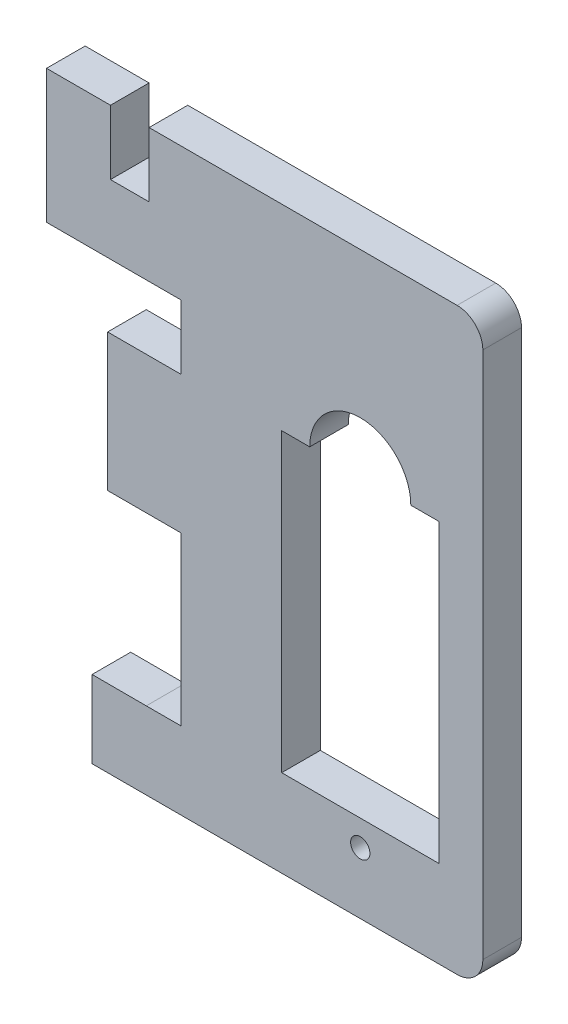
ISO-10303-21;
HEADER;
FILE_DESCRIPTION(('STEP AP214'),'2;1');
FILE_NAME('part.step','',(''),(''),'','','');
FILE_SCHEMA(('AUTOMOTIVE_DESIGN { 1 0 10303 214 1 1 1 1 }'));
ENDSEC;
DATA;
#1=APPLICATION_CONTEXT('core data for automotive mechanical design processes');
#2=APPLICATION_PROTOCOL_DEFINITION('international standard','automotive_design',2000,#1);
#3=PRODUCT_CONTEXT('',#1,'mechanical');
#4=PRODUCT('Part','Part','',(#3));
#5=PRODUCT_RELATED_PRODUCT_CATEGORY('part','',(#4));
#6=PRODUCT_DEFINITION_FORMATION('','',#4);
#7=PRODUCT_DEFINITION_CONTEXT('part definition',#1,'design');
#8=PRODUCT_DEFINITION('design','',#6,#7);
#9=PRODUCT_DEFINITION_SHAPE('','',#8);
#10=(LENGTH_UNIT() NAMED_UNIT(*) SI_UNIT(.MILLI.,.METRE.));
#11=(NAMED_UNIT(*) PLANE_ANGLE_UNIT() SI_UNIT($,.RADIAN.));
#12=(NAMED_UNIT(*) SI_UNIT($,.STERADIAN.) SOLID_ANGLE_UNIT());
#13=UNCERTAINTY_MEASURE_WITH_UNIT(LENGTH_MEASURE(1.E-05),#10,'distance_accuracy_value','');
#14=(GEOMETRIC_REPRESENTATION_CONTEXT(3) GLOBAL_UNCERTAINTY_ASSIGNED_CONTEXT((#13)) GLOBAL_UNIT_ASSIGNED_CONTEXT((#10,
#11,#12)) REPRESENTATION_CONTEXT('',''));
#15=CARTESIAN_POINT('',(0.,0.,0.));
#16=DIRECTION('',(0.,0.,1.));
#17=DIRECTION('',(1.,0.,0.));
#18=AXIS2_PLACEMENT_3D('',#15,#16,#17);
#19=CARTESIAN_POINT('',(-16.2431205040282,-16.6158037405696,0.));
#20=DIRECTION('',(0.,1.,0.));
#21=DIRECTION('',(-1.,0.,0.));
#22=AXIS2_PLACEMENT_3D('',#19,#20,#21);
#23=PLANE('',#22);
#24=DIRECTION('',(-1.,0.,0.));
#25=VECTOR('',#24,1.);
#26=CARTESIAN_POINT('',(-16.2431205040282,-16.6158037405696,0.));
#27=LINE('',#26,#25);
#28=CARTESIAN_POINT('',(-14.0681205040282,-16.6158037405696,0.));
#29=VERTEX_POINT('',#28);
#30=CARTESIAN_POINT('',(-16.2431205040282,-16.6158037405696,0.));
#31=VERTEX_POINT('',#30);
#32=EDGE_CURVE('E631',#29,#31,#27,.T.);
#33=ORIENTED_EDGE('',*,*,#32,.F.);
#34=DIRECTION('',(0.,0.,1.));
#35=VECTOR('',#34,1.);
#36=CARTESIAN_POINT('',(-14.0681205040282,-16.6158037405696,0.));
#37=LINE('',#36,#35);
#38=CARTESIAN_POINT('',(-14.0681205040282,-16.6158037405696,3.));
#39=VERTEX_POINT('',#38);
#40=EDGE_CURVE('E11',#29,#39,#37,.T.);
#41=ORIENTED_EDGE('',*,*,#40,.T.);
#42=DIRECTION('',(-1.,0.,0.));
#43=VECTOR('',#42,1.);
#44=CARTESIAN_POINT('',(-16.2431205040282,-16.6158037405696,3.));
#45=LINE('',#44,#43);
#46=CARTESIAN_POINT('',(-16.2431205040282,-16.6158037405696,3.));
#47=VERTEX_POINT('',#46);
#48=EDGE_CURVE('E216',#39,#47,#45,.T.);
#49=ORIENTED_EDGE('',*,*,#48,.T.);
#50=DIRECTION('',(0.,0.,1.));
#51=VECTOR('',#50,1.);
#52=CARTESIAN_POINT('',(-16.2431205040282,-16.6158037405696,0.));
#53=LINE('',#52,#51);
#54=EDGE_CURVE('E231',#31,#47,#53,.T.);
#55=ORIENTED_EDGE('',*,*,#54,.F.);
#56=EDGE_LOOP('',(#33,#41,#49,#55));
#57=FACE_BOUND('',#56,.T.);
#58=ADVANCED_FACE('F36',(#57),#23,.F.);
#59=CARTESIAN_POINT('',(-29.7617959455415,-11.7350085178876,3.));
#60=DIRECTION('',(0.,1.,0.));
#61=DIRECTION('',(0.,0.,1.));
#62=AXIS2_PLACEMENT_3D('',#59,#60,#61);
#63=PLANE('',#62);
#64=DIRECTION('',(1.,0.,0.));
#65=VECTOR('',#64,1.);
#66=CARTESIAN_POINT('',(-29.7617959455415,-11.7350085178876,0.));
#67=LINE('',#66,#65);
#68=CARTESIAN_POINT('',(-34.5063516050756,-11.7350085178875,0.));
#69=VERTEX_POINT('',#68);
#70=CARTESIAN_POINT('',(-24.0650463455694,-11.7350085178876,0.));
#71=VERTEX_POINT('',#70);
#72=EDGE_CURVE('E233',#69,#71,#67,.T.);
#73=ORIENTED_EDGE('',*,*,#72,.T.);
#74=DIRECTION('',(0.,0.,-1.));
#75=VECTOR('',#74,1.);
#76=CARTESIAN_POINT('',(-24.0650463455694,-11.7350085178876,3.));
#77=LINE('',#76,#75);
#78=CARTESIAN_POINT('',(-24.0650463455694,-11.7350085178876,3.));
#79=VERTEX_POINT('',#78);
#80=EDGE_CURVE('E208',#79,#71,#77,.T.);
#81=ORIENTED_EDGE('',*,*,#80,.F.);
#82=DIRECTION('',(1.,0.,0.));
#83=VECTOR('',#82,1.);
#84=CARTESIAN_POINT('',(-34.5063516050756,-11.7350085178875,3.));
#85=LINE('',#84,#83);
#86=CARTESIAN_POINT('',(-34.5063516050756,-11.7350085178875,3.));
#87=VERTEX_POINT('',#86);
#88=EDGE_CURVE('E240',#87,#79,#85,.T.);
#89=ORIENTED_EDGE('',*,*,#88,.F.);
#90=DIRECTION('',(0.,0.,-1.));
#91=VECTOR('',#90,1.);
#92=CARTESIAN_POINT('',(-34.5063516050756,-11.7350085178875,3.));
#93=LINE('',#92,#91);
#94=EDGE_CURVE('E279',#87,#69,#93,.T.);
#95=ORIENTED_EDGE('',*,*,#94,.T.);
#96=EDGE_LOOP('',(#73,#81,#89,#95));
#97=FACE_BOUND('',#96,.T.);
#98=ADVANCED_FACE('F38',(#97),#63,.F.);
#99=CARTESIAN_POINT('',(-24.0650463455694,-11.7350085178876,3.));
#100=DIRECTION('',(1.,0.,0.));
#101=DIRECTION('',(0.,0.,-1.));
#102=AXIS2_PLACEMENT_3D('',#99,#100,#101);
#103=PLANE('',#102);
#104=DIRECTION('',(0.,-1.,0.));
#105=VECTOR('',#104,1.);
#106=CARTESIAN_POINT('',(-24.0650463455694,-11.7350085178876,0.));
#107=LINE('',#106,#105);
#108=CARTESIAN_POINT('',(-24.0650463455694,-16.7350085178876,0.));
#109=VERTEX_POINT('',#108);
#110=EDGE_CURVE('E281',#71,#109,#107,.T.);
#111=ORIENTED_EDGE('',*,*,#110,.T.);
#112=DIRECTION('',(0.,0.,-1.));
#113=VECTOR('',#112,1.);
#114=CARTESIAN_POINT('',(-24.0650463455694,-16.7350085178876,3.));
#115=LINE('',#114,#113);
#116=CARTESIAN_POINT('',(-24.0650463455694,-16.7350085178876,3.));
#117=VERTEX_POINT('',#116);
#118=EDGE_CURVE('E368',#117,#109,#115,.T.);
#119=ORIENTED_EDGE('',*,*,#118,.F.);
#120=DIRECTION('',(0.,-1.,0.));
#121=VECTOR('',#120,1.);
#122=CARTESIAN_POINT('',(-24.0650463455694,-11.7350085178876,3.));
#123=LINE('',#122,#121);
#124=EDGE_CURVE('E242',#79,#117,#123,.T.);
#125=ORIENTED_EDGE('',*,*,#124,.F.);
#126=ORIENTED_EDGE('',*,*,#80,.T.);
#127=EDGE_LOOP('',(#111,#119,#125,#126));
#128=FACE_BOUND('',#127,.T.);
#129=ADVANCED_FACE('F376',(#128),#103,.F.);
#130=CARTESIAN_POINT('',(-24.0650463455694,-16.7350085178876,3.));
#131=DIRECTION('',(0.,-1.,0.));
#132=DIRECTION('',(0.,0.,-1.));
#133=AXIS2_PLACEMENT_3D('',#130,#131,#132);
#134=PLANE('',#133);
#135=DIRECTION('',(-1.,0.,0.));
#136=VECTOR('',#135,1.);
#137=CARTESIAN_POINT('',(-24.0650463455694,-16.7350085178876,0.));
#138=LINE('',#137,#136);
#139=CARTESIAN_POINT('',(-29.7617959455415,-16.7350085178876,0.));
#140=VERTEX_POINT('',#139);
#141=EDGE_CURVE('E283',#109,#140,#138,.T.);
#142=ORIENTED_EDGE('',*,*,#141,.T.);
#143=DIRECTION('',(0.,0.,-1.));
#144=VECTOR('',#143,1.);
#145=CARTESIAN_POINT('',(-29.7617959455415,-16.7350085178876,3.));
#146=LINE('',#145,#144);
#147=CARTESIAN_POINT('',(-29.7617959455415,-16.7350085178876,3.));
#148=VERTEX_POINT('',#147);
#149=EDGE_CURVE('E365',#148,#140,#146,.T.);
#150=ORIENTED_EDGE('',*,*,#149,.F.);
#151=DIRECTION('',(-1.,0.,0.));
#152=VECTOR('',#151,1.);
#153=CARTESIAN_POINT('',(-24.0650463455694,-16.7350085178876,3.));
#154=LINE('',#153,#152);
#155=EDGE_CURVE('E245',#117,#148,#154,.T.);
#156=ORIENTED_EDGE('',*,*,#155,.F.);
#157=ORIENTED_EDGE('',*,*,#118,.T.);
#158=EDGE_LOOP('',(#142,#150,#156,#157));
#159=FACE_BOUND('',#158,.T.);
#160=ADVANCED_FACE('F388',(#159),#134,.F.);
#161=CARTESIAN_POINT('',(-29.7617959455415,-16.7350085178876,3.));
#162=DIRECTION('',(1.,0.,0.));
#163=DIRECTION('',(0.,0.,-1.));
#164=AXIS2_PLACEMENT_3D('',#161,#162,#163);
#165=PLANE('',#164);
#166=DIRECTION('',(0.,-1.,0.));
#167=VECTOR('',#166,1.);
#168=CARTESIAN_POINT('',(-29.7617959455415,-16.7350085178876,0.));
#169=LINE('',#168,#167);
#170=CARTESIAN_POINT('',(-29.7617959455415,-27.4012776831346,0.));
#171=VERTEX_POINT('',#170);
#172=EDGE_CURVE('E285',#140,#171,#169,.T.);
#173=ORIENTED_EDGE('',*,*,#172,.T.);
#174=DIRECTION('',(0.,0.,-1.));
#175=VECTOR('',#174,1.);
#176=CARTESIAN_POINT('',(-29.7617959455415,-27.4012776831346,3.));
#177=LINE('',#176,#175);
#178=CARTESIAN_POINT('',(-29.7617959455415,-27.4012776831346,3.));
#179=VERTEX_POINT('',#178);
#180=EDGE_CURVE('E362',#179,#171,#177,.T.);
#181=ORIENTED_EDGE('',*,*,#180,.F.);
#182=DIRECTION('',(0.,-1.,0.));
#183=VECTOR('',#182,1.);
#184=CARTESIAN_POINT('',(-29.7617959455415,-16.7350085178876,3.));
#185=LINE('',#184,#183);
#186=EDGE_CURVE('E247',#148,#179,#185,.T.);
#187=ORIENTED_EDGE('',*,*,#186,.F.);
#188=ORIENTED_EDGE('',*,*,#149,.T.);
#189=EDGE_LOOP('',(#173,#181,#187,#188));
#190=FACE_BOUND('',#189,.T.);
#191=ADVANCED_FACE('F392',(#190),#165,.F.);
#192=CARTESIAN_POINT('',(-29.7617959455415,-27.4012776831346,3.));
#193=DIRECTION('',(0.,1.,0.));
#194=DIRECTION('',(0.,0.,1.));
#195=AXIS2_PLACEMENT_3D('',#192,#193,#194);
#196=PLANE('',#195);
#197=DIRECTION('',(1.,0.,0.));
#198=VECTOR('',#197,1.);
#199=CARTESIAN_POINT('',(-29.7617959455415,-27.4012776831346,0.));
#200=LINE('',#199,#198);
#201=CARTESIAN_POINT('',(-24.0650463455694,-27.4012776831346,0.));
#202=VERTEX_POINT('',#201);
#203=EDGE_CURVE('E287',#171,#202,#200,.T.);
#204=ORIENTED_EDGE('',*,*,#203,.T.);
#205=DIRECTION('',(0.,0.,-1.));
#206=VECTOR('',#205,1.);
#207=CARTESIAN_POINT('',(-24.0650463455694,-27.4012776831346,3.));
#208=LINE('',#207,#206);
#209=CARTESIAN_POINT('',(-24.0650463455694,-27.4012776831346,3.));
#210=VERTEX_POINT('',#209);
#211=EDGE_CURVE('E359',#210,#202,#208,.T.);
#212=ORIENTED_EDGE('',*,*,#211,.F.);
#213=DIRECTION('',(1.,0.,0.));
#214=VECTOR('',#213,1.);
#215=CARTESIAN_POINT('',(-29.7617959455415,-27.4012776831346,3.));
#216=LINE('',#215,#214);
#217=EDGE_CURVE('E249',#179,#210,#216,.T.);
#218=ORIENTED_EDGE('',*,*,#217,.F.);
#219=ORIENTED_EDGE('',*,*,#180,.T.);
#220=EDGE_LOOP('',(#204,#212,#218,#219));
#221=FACE_BOUND('',#220,.T.);
#222=ADVANCED_FACE('F466',(#221),#196,.F.);
#223=CARTESIAN_POINT('',(-24.0650463455694,-27.4012776831346,3.));
#224=DIRECTION('',(1.,0.,0.));
#225=DIRECTION('',(0.,0.,-1.));
#226=AXIS2_PLACEMENT_3D('',#223,#224,#225);
#227=PLANE('',#226);
#228=DIRECTION('',(0.,-1.,0.));
#229=VECTOR('',#228,1.);
#230=CARTESIAN_POINT('',(-24.0650463455694,-27.4012776831346,0.));
#231=LINE('',#230,#229);
#232=CARTESIAN_POINT('',(-24.0650463455694,-40.3800883305045,0.));
#233=VERTEX_POINT('',#232);
#234=EDGE_CURVE('E289',#202,#233,#231,.T.);
#235=ORIENTED_EDGE('',*,*,#234,.T.);
#236=DIRECTION('',(0.,0.,-1.));
#237=VECTOR('',#236,1.);
#238=CARTESIAN_POINT('',(-24.0650463455694,-40.3800883305045,3.));
#239=LINE('',#238,#237);
#240=CARTESIAN_POINT('',(-24.0650463455694,-40.3800883305045,3.));
#241=VERTEX_POINT('',#240);
#242=EDGE_CURVE('E356',#241,#233,#239,.T.);
#243=ORIENTED_EDGE('',*,*,#242,.F.);
#244=DIRECTION('',(0.,-1.,0.));
#245=VECTOR('',#244,1.);
#246=CARTESIAN_POINT('',(-24.0650463455694,-27.4012776831346,3.));
#247=LINE('',#246,#245);
#248=EDGE_CURVE('E251',#210,#241,#247,.T.);
#249=ORIENTED_EDGE('',*,*,#248,.F.);
#250=ORIENTED_EDGE('',*,*,#211,.T.);
#251=EDGE_LOOP('',(#235,#243,#249,#250));
#252=FACE_BOUND('',#251,.T.);
#253=ADVANCED_FACE('F464',(#252),#227,.F.);
#254=CARTESIAN_POINT('',(-24.0650463455694,-40.3800883305045,3.));
#255=DIRECTION('',(0.,-1.,0.));
#256=DIRECTION('',(1.,0.,0.));
#257=AXIS2_PLACEMENT_3D('',#254,#255,#256);
#258=PLANE('',#257);
#259=DIRECTION('',(-1.,0.,0.));
#260=VECTOR('',#259,1.);
#261=CARTESIAN_POINT('',(-24.0650463455694,-40.3800883305045,0.));
#262=LINE('',#261,#260);
#263=CARTESIAN_POINT('',(-26.7617959455415,-40.3800883305045,0.));
#264=VERTEX_POINT('',#263);
#265=EDGE_CURVE('E291',#233,#264,#262,.T.);
#266=ORIENTED_EDGE('',*,*,#265,.T.);
#267=DIRECTION('',(0.,0.,-1.));
#268=VECTOR('',#267,1.);
#269=CARTESIAN_POINT('',(-26.7617959455415,-40.3800883305045,3.));
#270=LINE('',#269,#268);
#271=CARTESIAN_POINT('',(-26.7617959455415,-40.3800883305045,3.));
#272=VERTEX_POINT('',#271);
#273=EDGE_CURVE('E353',#272,#264,#270,.T.);
#274=ORIENTED_EDGE('',*,*,#273,.F.);
#275=DIRECTION('',(-1.,0.,0.));
#276=VECTOR('',#275,1.);
#277=CARTESIAN_POINT('',(-24.0650463455694,-40.3800883305045,3.));
#278=LINE('',#277,#276);
#279=EDGE_CURVE('E253',#241,#272,#278,.T.);
#280=ORIENTED_EDGE('',*,*,#279,.F.);
#281=ORIENTED_EDGE('',*,*,#242,.T.);
#282=EDGE_LOOP('',(#266,#274,#280,#281));
#283=FACE_BOUND('',#282,.T.);
#284=ADVANCED_FACE('F459',(#283),#258,.F.);
#285=CARTESIAN_POINT('',(-26.7617959455415,-40.3800883305045,3.));
#286=DIRECTION('',(-0.00187434244579755,-0.999998243418655,0.));
#287=DIRECTION('',(0.999998243418655,-0.00187434244579755,0.));
#288=AXIS2_PLACEMENT_3D('',#285,#286,#287);
#289=PLANE('',#288);
#290=DIRECTION('',(-0.999998243418655,0.00187434244579755,0.));
#291=VECTOR('',#290,1.);
#292=CARTESIAN_POINT('',(-26.7617959455415,-40.3800883305045,0.));
#293=LINE('',#292,#291);
#294=CARTESIAN_POINT('',(-30.9665558202005,-40.3722071567532,0.));
#295=VERTEX_POINT('',#294);
#296=EDGE_CURVE('E293',#264,#295,#293,.T.);
#297=ORIENTED_EDGE('',*,*,#296,.T.);
#298=DIRECTION('',(0.,0.,-1.));
#299=VECTOR('',#298,1.);
#300=CARTESIAN_POINT('',(-30.9665558202005,-40.3722071567532,3.));
#301=LINE('',#300,#299);
#302=CARTESIAN_POINT('',(-30.9665558202005,-40.3722071567532,3.));
#303=VERTEX_POINT('',#302);
#304=EDGE_CURVE('E350',#303,#295,#301,.T.);
#305=ORIENTED_EDGE('',*,*,#304,.F.);
#306=DIRECTION('',(-0.999998243418655,0.00187434244579755,0.));
#307=VECTOR('',#306,1.);
#308=CARTESIAN_POINT('',(-26.7617959455415,-40.3800883305045,3.));
#309=LINE('',#308,#307);
#310=EDGE_CURVE('E255',#272,#303,#309,.T.);
#311=ORIENTED_EDGE('',*,*,#310,.F.);
#312=ORIENTED_EDGE('',*,*,#273,.T.);
#313=EDGE_LOOP('',(#297,#305,#311,#312));
#314=FACE_BOUND('',#313,.T.);
#315=ADVANCED_FACE('F454',(#314),#289,.F.);
#316=CARTESIAN_POINT('',(-30.9665558202005,-40.3722071567532,3.));
#317=DIRECTION('',(1.,0.,0.));
#318=DIRECTION('',(0.,0.,-1.));
#319=AXIS2_PLACEMENT_3D('',#316,#317,#318);
#320=PLANE('',#319);
#321=DIRECTION('',(0.,-1.,0.));
#322=VECTOR('',#321,1.);
#323=CARTESIAN_POINT('',(-30.9665558202005,-40.3722071567532,0.));
#324=LINE('',#323,#322);
#325=CARTESIAN_POINT('',(-30.9665558202005,-46.3777683134583,0.));
#326=VERTEX_POINT('',#325);
#327=EDGE_CURVE('E295',#295,#326,#324,.T.);
#328=ORIENTED_EDGE('',*,*,#327,.T.);
#329=DIRECTION('',(0.,0.,-1.));
#330=VECTOR('',#329,1.);
#331=CARTESIAN_POINT('',(-30.9665558202005,-46.3777683134583,3.));
#332=LINE('',#331,#330);
#333=CARTESIAN_POINT('',(-30.9665558202005,-46.3777683134583,3.));
#334=VERTEX_POINT('',#333);
#335=EDGE_CURVE('E347',#334,#326,#332,.T.);
#336=ORIENTED_EDGE('',*,*,#335,.F.);
#337=DIRECTION('',(0.,-1.,0.));
#338=VECTOR('',#337,1.);
#339=CARTESIAN_POINT('',(-30.9665558202005,-40.3722071567532,3.));
#340=LINE('',#339,#338);
#341=EDGE_CURVE('E257',#303,#334,#340,.T.);
#342=ORIENTED_EDGE('',*,*,#341,.F.);
#343=ORIENTED_EDGE('',*,*,#304,.T.);
#344=EDGE_LOOP('',(#328,#336,#342,#343));
#345=FACE_BOUND('',#344,.T.);
#346=ADVANCED_FACE('F449',(#345),#320,.F.);
#347=CARTESIAN_POINT('',(-27.7617959455415,-46.3777683134583,3.));
#348=DIRECTION('',(0.,1.,0.));
#349=DIRECTION('',(-1.,0.,0.));
#350=AXIS2_PLACEMENT_3D('',#347,#348,#349);
#351=PLANE('',#350);
#352=DIRECTION('',(1.,0.,0.));
#353=VECTOR('',#352,1.);
#354=CARTESIAN_POINT('',(-27.7617959455415,-46.3777683134583,0.));
#355=LINE('',#354,#353);
#356=CARTESIAN_POINT('',(-2.62448457296451,-46.3777683134583,0.));
#357=VERTEX_POINT('',#356);
#358=EDGE_CURVE('E298',#326,#357,#355,.T.);
#359=ORIENTED_EDGE('',*,*,#358,.T.);
#360=DIRECTION('',(0.,0.,-1.));
#361=VECTOR('',#360,1.);
#362=CARTESIAN_POINT('',(-2.62448457296451,-46.3777683134583,3.));
#363=LINE('',#362,#361);
#364=CARTESIAN_POINT('',(-2.62448457296451,-46.3777683134583,3.));
#365=VERTEX_POINT('',#364);
#366=EDGE_CURVE('E344',#365,#357,#363,.T.);
#367=ORIENTED_EDGE('',*,*,#366,.F.);
#368=DIRECTION('',(1.,0.,0.));
#369=VECTOR('',#368,1.);
#370=CARTESIAN_POINT('',(-30.9665558202005,-46.3777683134583,3.));
#371=LINE('',#370,#369);
#372=EDGE_CURVE('E259',#334,#365,#371,.T.);
#373=ORIENTED_EDGE('',*,*,#372,.F.);
#374=ORIENTED_EDGE('',*,*,#335,.T.);
#375=EDGE_LOOP('',(#359,#367,#373,#374));
#376=FACE_BOUND('',#375,.T.);
#377=ADVANCED_FACE('F444',(#376),#351,.F.);
#378=CARTESIAN_POINT('',(-2.62448457296451,-44.3777683134583,3.));
#379=DIRECTION('',(0.,0.,-1.));
#380=DIRECTION('',(-1.,0.,0.));
#381=AXIS2_PLACEMENT_3D('',#378,#379,#380);
#382=CYLINDRICAL_SURFACE('',#381,2.);
#383=CARTESIAN_POINT('',(-2.62448457296451,-44.3777683134583,0.));
#384=DIRECTION('',(0.,0.,1.));
#385=DIRECTION('',(1.,0.,0.));
#386=AXIS2_PLACEMENT_3D('',#383,#384,#385);
#387=CIRCLE('',#386,2.);
#388=CARTESIAN_POINT('',(-0.624484572964512,-44.3777683134583,0.));
#389=VERTEX_POINT('',#388);
#390=EDGE_CURVE('E300',#357,#389,#387,.T.);
#391=ORIENTED_EDGE('',*,*,#390,.T.);
#392=DIRECTION('',(0.,0.,-1.));
#393=VECTOR('',#392,1.);
#394=CARTESIAN_POINT('',(-0.624484572964512,-44.3777683134583,3.));
#395=LINE('',#394,#393);
#396=CARTESIAN_POINT('',(-0.624484572964512,-44.3777683134583,3.));
#397=VERTEX_POINT('',#396);
#398=EDGE_CURVE('E341',#397,#389,#395,.T.);
#399=ORIENTED_EDGE('',*,*,#398,.F.);
#400=CARTESIAN_POINT('',(-2.62448457296451,-44.3777683134583,3.));
#401=DIRECTION('',(0.,0.,1.));
#402=DIRECTION('',(1.,0.,0.));
#403=AXIS2_PLACEMENT_3D('',#400,#401,#402);
#404=CIRCLE('',#403,2.);
#405=EDGE_CURVE('E261',#365,#397,#404,.T.);
#406=ORIENTED_EDGE('',*,*,#405,.F.);
#407=ORIENTED_EDGE('',*,*,#366,.T.);
#408=EDGE_LOOP('',(#391,#399,#406,#407));
#409=FACE_BOUND('',#408,.T.);
#410=ADVANCED_FACE('F440',(#409),#382,.T.);
#411=CARTESIAN_POINT('',(-0.624484572964518,-3.37776831345827,3.));
#412=DIRECTION('',(-1.,0.,0.));
#413=DIRECTION('',(0.,-1.,0.));
#414=AXIS2_PLACEMENT_3D('',#411,#412,#413);
#415=PLANE('',#414);
#416=DIRECTION('',(0.,1.,0.));
#417=VECTOR('',#416,1.);
#418=CARTESIAN_POINT('',(-0.624484572964518,-3.37776831345827,0.));
#419=LINE('',#418,#417);
#420=CARTESIAN_POINT('',(-0.624484572964517,-3.37776831345827,0.));
#421=VERTEX_POINT('',#420);
#422=EDGE_CURVE('E302',#389,#421,#419,.T.);
#423=ORIENTED_EDGE('',*,*,#422,.T.);
#424=DIRECTION('',(0.,0.,-1.));
#425=VECTOR('',#424,1.);
#426=CARTESIAN_POINT('',(-0.624484572964517,-3.37776831345827,3.));
#427=LINE('',#426,#425);
#428=CARTESIAN_POINT('',(-0.624484572964517,-3.37776831345827,3.));
#429=VERTEX_POINT('',#428);
#430=EDGE_CURVE('E338',#429,#421,#427,.T.);
#431=ORIENTED_EDGE('',*,*,#430,.F.);
#432=DIRECTION('',(0.,1.,0.));
#433=VECTOR('',#432,1.);
#434=CARTESIAN_POINT('',(-0.624484572964518,-3.37776831345827,3.));
#435=LINE('',#434,#433);
#436=EDGE_CURVE('E263',#397,#429,#435,.T.);
#437=ORIENTED_EDGE('',*,*,#436,.F.);
#438=ORIENTED_EDGE('',*,*,#398,.T.);
#439=EDGE_LOOP('',(#423,#431,#437,#438));
#440=FACE_BOUND('',#439,.T.);
#441=ADVANCED_FACE('F435',(#440),#415,.F.);
#442=CARTESIAN_POINT('',(-2.62448457296452,-3.37776831345827,3.));
#443=DIRECTION('',(0.,0.,-1.));
#444=DIRECTION('',(-1.,0.,0.));
#445=AXIS2_PLACEMENT_3D('',#442,#443,#444);
#446=CYLINDRICAL_SURFACE('',#445,2.);
#447=CARTESIAN_POINT('',(-2.62448457296452,-3.37776831345827,0.));
#448=DIRECTION('',(0.,0.,1.));
#449=DIRECTION('',(-1.,0.,0.));
#450=AXIS2_PLACEMENT_3D('',#447,#448,#449);
#451=CIRCLE('',#450,2.);
#452=CARTESIAN_POINT('',(-2.62448457296452,-1.37776831345827,0.));
#453=VERTEX_POINT('',#452);
#454=EDGE_CURVE('E304',#421,#453,#451,.T.);
#455=ORIENTED_EDGE('',*,*,#454,.T.);
#456=DIRECTION('',(0.,0.,-1.));
#457=VECTOR('',#456,1.);
#458=CARTESIAN_POINT('',(-2.62448457296452,-1.37776831345827,3.));
#459=LINE('',#458,#457);
#460=CARTESIAN_POINT('',(-2.62448457296452,-1.37776831345827,3.));
#461=VERTEX_POINT('',#460);
#462=EDGE_CURVE('E335',#461,#453,#459,.T.);
#463=ORIENTED_EDGE('',*,*,#462,.F.);
#464=CARTESIAN_POINT('',(-2.62448457296452,-3.37776831345827,3.));
#465=DIRECTION('',(0.,0.,1.));
#466=DIRECTION('',(-1.,0.,0.));
#467=AXIS2_PLACEMENT_3D('',#464,#465,#466);
#468=CIRCLE('',#467,2.);
#469=EDGE_CURVE('E265',#429,#461,#468,.T.);
#470=ORIENTED_EDGE('',*,*,#469,.F.);
#471=ORIENTED_EDGE('',*,*,#430,.T.);
#472=EDGE_LOOP('',(#455,#463,#470,#471));
#473=FACE_BOUND('',#472,.T.);
#474=ADVANCED_FACE('F430',(#473),#446,.T.);
#475=CARTESIAN_POINT('',(-26.5401381538285,-1.37776831345827,3.));
#476=DIRECTION('',(0.,-1.,0.));
#477=DIRECTION('',(0.,0.,-1.));
#478=AXIS2_PLACEMENT_3D('',#475,#476,#477);
#479=PLANE('',#478);
#480=DIRECTION('',(-1.,0.,0.));
#481=VECTOR('',#480,1.);
#482=CARTESIAN_POINT('',(-26.5401381538285,-1.37776831345827,0.));
#483=LINE('',#482,#481);
#484=CARTESIAN_POINT('',(-26.5401381538285,-1.37776831345827,0.));
#485=VERTEX_POINT('',#484);
#486=EDGE_CURVE('E306',#453,#485,#483,.T.);
#487=ORIENTED_EDGE('',*,*,#486,.T.);
#488=DIRECTION('',(0.,0.,-1.));
#489=VECTOR('',#488,1.);
#490=CARTESIAN_POINT('',(-26.5401381538285,-1.37776831345827,3.));
#491=LINE('',#490,#489);
#492=CARTESIAN_POINT('',(-26.5401381538285,-1.37776831345827,3.));
#493=VERTEX_POINT('',#492);
#494=EDGE_CURVE('E332',#493,#485,#491,.T.);
#495=ORIENTED_EDGE('',*,*,#494,.F.);
#496=DIRECTION('',(-1.,0.,0.));
#497=VECTOR('',#496,1.);
#498=CARTESIAN_POINT('',(-26.5401381538285,-1.37776831345827,3.));
#499=LINE('',#498,#497);
#500=EDGE_CURVE('E267',#461,#493,#499,.T.);
#501=ORIENTED_EDGE('',*,*,#500,.F.);
#502=ORIENTED_EDGE('',*,*,#462,.T.);
#503=EDGE_LOOP('',(#487,#495,#501,#502));
#504=FACE_BOUND('',#503,.T.);
#505=ADVANCED_FACE('F426',(#504),#479,.F.);
#506=CARTESIAN_POINT('',(-26.5401381538285,-1.37776831345827,3.));
#507=DIRECTION('',(1.,0.,0.));
#508=DIRECTION('',(0.,0.,-1.));
#509=AXIS2_PLACEMENT_3D('',#506,#507,#508);
#510=PLANE('',#509);
#511=DIRECTION('',(0.,-1.,0.));
#512=VECTOR('',#511,1.);
#513=CARTESIAN_POINT('',(-26.5401381538285,-1.37776831345827,0.));
#514=LINE('',#513,#512);
#515=CARTESIAN_POINT('',(-26.5401381538285,-6.37776831345827,0.));
#516=VERTEX_POINT('',#515);
#517=EDGE_CURVE('E308',#485,#516,#514,.T.);
#518=ORIENTED_EDGE('',*,*,#517,.T.);
#519=DIRECTION('',(0.,0.,-1.));
#520=VECTOR('',#519,1.);
#521=CARTESIAN_POINT('',(-26.5401381538285,-6.37776831345827,3.));
#522=LINE('',#521,#520);
#523=CARTESIAN_POINT('',(-26.5401381538285,-6.37776831345827,3.));
#524=VERTEX_POINT('',#523);
#525=EDGE_CURVE('E329',#524,#516,#522,.T.);
#526=ORIENTED_EDGE('',*,*,#525,.F.);
#527=DIRECTION('',(0.,-1.,0.));
#528=VECTOR('',#527,1.);
#529=CARTESIAN_POINT('',(-26.5401381538285,-1.37776831345827,3.));
#530=LINE('',#529,#528);
#531=EDGE_CURVE('E269',#493,#524,#530,.T.);
#532=ORIENTED_EDGE('',*,*,#531,.F.);
#533=ORIENTED_EDGE('',*,*,#494,.T.);
#534=EDGE_LOOP('',(#518,#526,#532,#533));
#535=FACE_BOUND('',#534,.T.);
#536=ADVANCED_FACE('F421',(#535),#510,.F.);
#537=CARTESIAN_POINT('',(-29.5401381538285,-6.37776831345827,3.));
#538=DIRECTION('',(0.,-1.,0.));
#539=DIRECTION('',(0.,0.,-1.));
#540=AXIS2_PLACEMENT_3D('',#537,#538,#539);
#541=PLANE('',#540);
#542=DIRECTION('',(-1.,0.,0.));
#543=VECTOR('',#542,1.);
#544=CARTESIAN_POINT('',(-29.5401381538285,-6.37776831345827,0.));
#545=LINE('',#544,#543);
#546=CARTESIAN_POINT('',(-29.5401381538285,-6.37776831345827,0.));
#547=VERTEX_POINT('',#546);
#548=EDGE_CURVE('E310',#516,#547,#545,.T.);
#549=ORIENTED_EDGE('',*,*,#548,.T.);
#550=DIRECTION('',(0.,0.,-1.));
#551=VECTOR('',#550,1.);
#552=CARTESIAN_POINT('',(-29.5401381538285,-6.37776831345827,3.));
#553=LINE('',#552,#551);
#554=CARTESIAN_POINT('',(-29.5401381538285,-6.37776831345827,3.));
#555=VERTEX_POINT('',#554);
#556=EDGE_CURVE('E326',#555,#547,#553,.T.);
#557=ORIENTED_EDGE('',*,*,#556,.F.);
#558=DIRECTION('',(-1.,0.,0.));
#559=VECTOR('',#558,1.);
#560=CARTESIAN_POINT('',(-29.5401381538285,-6.37776831345827,3.));
#561=LINE('',#560,#559);
#562=EDGE_CURVE('E271',#524,#555,#561,.T.);
#563=ORIENTED_EDGE('',*,*,#562,.F.);
#564=ORIENTED_EDGE('',*,*,#525,.T.);
#565=EDGE_LOOP('',(#549,#557,#563,#564));
#566=FACE_BOUND('',#565,.T.);
#567=ADVANCED_FACE('F415',(#566),#541,.F.);
#568=CARTESIAN_POINT('',(-29.5401381538285,-1.37776831345827,3.));
#569=DIRECTION('',(-1.,0.,0.));
#570=DIRECTION('',(0.,0.,1.));
#571=AXIS2_PLACEMENT_3D('',#568,#569,#570);
#572=PLANE('',#571);
#573=DIRECTION('',(0.,1.,0.));
#574=VECTOR('',#573,1.);
#575=CARTESIAN_POINT('',(-29.5401381538285,-1.37776831345827,0.));
#576=LINE('',#575,#574);
#577=CARTESIAN_POINT('',(-29.5401381538285,-1.37776831345827,0.));
#578=VERTEX_POINT('',#577);
#579=EDGE_CURVE('E312',#547,#578,#576,.T.);
#580=ORIENTED_EDGE('',*,*,#579,.T.);
#581=DIRECTION('',(0.,0.,-1.));
#582=VECTOR('',#581,1.);
#583=CARTESIAN_POINT('',(-29.5401381538285,-1.37776831345827,3.));
#584=LINE('',#583,#582);
#585=CARTESIAN_POINT('',(-29.5401381538285,-1.37776831345827,3.));
#586=VERTEX_POINT('',#585);
#587=EDGE_CURVE('E323',#586,#578,#584,.T.);
#588=ORIENTED_EDGE('',*,*,#587,.F.);
#589=DIRECTION('',(0.,1.,0.));
#590=VECTOR('',#589,1.);
#591=CARTESIAN_POINT('',(-29.5401381538285,-1.37776831345827,3.));
#592=LINE('',#591,#590);
#593=EDGE_CURVE('E273',#555,#586,#592,.T.);
#594=ORIENTED_EDGE('',*,*,#593,.F.);
#595=ORIENTED_EDGE('',*,*,#556,.T.);
#596=EDGE_LOOP('',(#580,#588,#594,#595));
#597=FACE_BOUND('',#596,.T.);
#598=ADVANCED_FACE('F411',(#597),#572,.F.);
#599=CARTESIAN_POINT('',(-34.5063516050756,-1.37776831345827,3.));
#600=DIRECTION('',(0.,-1.,0.));
#601=DIRECTION('',(0.,0.,-1.));
#602=AXIS2_PLACEMENT_3D('',#599,#600,#601);
#603=PLANE('',#602);
#604=DIRECTION('',(-1.,0.,0.));
#605=VECTOR('',#604,1.);
#606=CARTESIAN_POINT('',(-34.5063516050756,-1.37776831345827,0.));
#607=LINE('',#606,#605);
#608=CARTESIAN_POINT('',(-34.5063516050756,-1.37776831345827,0.));
#609=VERTEX_POINT('',#608);
#610=EDGE_CURVE('E314',#578,#609,#607,.T.);
#611=ORIENTED_EDGE('',*,*,#610,.T.);
#612=DIRECTION('',(0.,0.,-1.));
#613=VECTOR('',#612,1.);
#614=CARTESIAN_POINT('',(-34.5063516050756,-1.37776831345827,3.));
#615=LINE('',#614,#613);
#616=CARTESIAN_POINT('',(-34.5063516050756,-1.37776831345827,3.));
#617=VERTEX_POINT('',#616);
#618=EDGE_CURVE('E320',#617,#609,#615,.T.);
#619=ORIENTED_EDGE('',*,*,#618,.F.);
#620=DIRECTION('',(-1.,0.,0.));
#621=VECTOR('',#620,1.);
#622=CARTESIAN_POINT('',(-34.5063516050756,-1.37776831345827,3.));
#623=LINE('',#622,#621);
#624=EDGE_CURVE('E275',#586,#617,#623,.T.);
#625=ORIENTED_EDGE('',*,*,#624,.F.);
#626=ORIENTED_EDGE('',*,*,#587,.T.);
#627=EDGE_LOOP('',(#611,#619,#625,#626));
#628=FACE_BOUND('',#627,.T.);
#629=ADVANCED_FACE('F406',(#628),#603,.F.);
#630=CARTESIAN_POINT('',(-34.5063516050756,-1.37776831345827,3.));
#631=DIRECTION('',(1.,0.,0.));
#632=DIRECTION('',(0.,0.,-1.));
#633=AXIS2_PLACEMENT_3D('',#630,#631,#632);
#634=PLANE('',#633);
#635=DIRECTION('',(0.,-1.,0.));
#636=VECTOR('',#635,1.);
#637=CARTESIAN_POINT('',(-34.5063516050756,-1.37776831345827,0.));
#638=LINE('',#637,#636);
#639=EDGE_CURVE('E243',#609,#69,#638,.T.);
#640=ORIENTED_EDGE('',*,*,#639,.T.);
#641=ORIENTED_EDGE('',*,*,#94,.F.);
#642=DIRECTION('',(0.,-1.,0.));
#643=VECTOR('',#642,1.);
#644=CARTESIAN_POINT('',(-34.5063516050756,-1.37776831345827,3.));
#645=LINE('',#644,#643);
#646=EDGE_CURVE('E277',#617,#87,#645,.T.);
#647=ORIENTED_EDGE('',*,*,#646,.F.);
#648=ORIENTED_EDGE('',*,*,#618,.T.);
#649=EDGE_LOOP('',(#640,#641,#647,#648));
#650=FACE_BOUND('',#649,.T.);
#651=ADVANCED_FACE('F400',(#650),#634,.F.);
#652=CARTESIAN_POINT('',(-2.62448457296451,-44.3777683134583,3.));
#653=DIRECTION('',(0.,0.,1.));
#654=DIRECTION('',(1.,0.,0.));
#655=AXIS2_PLACEMENT_3D('',#652,#653,#654);
#656=PLANE('',#655);
#657=CARTESIAN_POINT('',(-10.1431205040282,-16.6158037405696,3.));
#658=DIRECTION('',(0.,0.,1.));
#659=DIRECTION('',(1.,0.,0.));
#660=AXIS2_PLACEMENT_3D('',#657,#658,#659);
#661=CIRCLE('',#660,3.925);
#662=CARTESIAN_POINT('',(-6.21812050402816,-16.6158037405696,3.));
#663=VERTEX_POINT('',#662);
#664=EDGE_CURVE('E203',#663,#39,#661,.T.);
#665=ORIENTED_EDGE('',*,*,#664,.F.);
#666=CARTESIAN_POINT('',(-4.04312050402816,-16.6158037405696,3.));
#667=VERTEX_POINT('',#666);
#668=EDGE_CURVE('E215',#667,#663,#45,.T.);
#669=ORIENTED_EDGE('',*,*,#668,.F.);
#670=DIRECTION('',(0.,1.,0.));
#671=VECTOR('',#670,1.);
#672=CARTESIAN_POINT('',(-4.04312050402816,-16.6158037405696,3.));
#673=LINE('',#672,#671);
#674=CARTESIAN_POINT('',(-4.04312050402816,-39.6158037405696,3.));
#675=VERTEX_POINT('',#674);
#676=EDGE_CURVE('E227',#675,#667,#673,.T.);
#677=ORIENTED_EDGE('',*,*,#676,.F.);
#678=DIRECTION('',(1.,0.,0.));
#679=VECTOR('',#678,1.);
#680=CARTESIAN_POINT('',(-16.2431205040282,-39.6158037405696,3.));
#681=LINE('',#680,#679);
#682=CARTESIAN_POINT('',(-16.2431205040282,-39.6158037405696,3.));
#683=VERTEX_POINT('',#682);
#684=EDGE_CURVE('E633',#683,#675,#681,.T.);
#685=ORIENTED_EDGE('',*,*,#684,.F.);
#686=DIRECTION('',(0.,-1.,0.));
#687=VECTOR('',#686,1.);
#688=CARTESIAN_POINT('',(-16.2431205040282,-16.6158037405696,3.));
#689=LINE('',#688,#687);
#690=EDGE_CURVE('E59',#47,#683,#689,.T.);
#691=ORIENTED_EDGE('',*,*,#690,.F.);
#692=ORIENTED_EDGE('',*,*,#48,.F.);
#693=EDGE_LOOP('',(#665,#669,#677,#685,#691,#692));
#694=FACE_BOUND('',#693,.T.);
#695=CARTESIAN_POINT('',(-10.1431205040282,-41.6158037405696,3.));
#696=DIRECTION('',(0.,0.,1.));
#697=DIRECTION('',(1.,0.,0.));
#698=AXIS2_PLACEMENT_3D('',#695,#696,#697);
#699=CIRCLE('',#698,0.75);
#700=CARTESIAN_POINT('',(-9.39312050402816,-41.6158037405696,3.));
#701=VERTEX_POINT('',#700);
#702=EDGE_CURVE('E622',#701,#701,#699,.T.);
#703=ORIENTED_EDGE('',*,*,#702,.F.);
#704=EDGE_LOOP('',(#703));
#705=FACE_BOUND('',#704,.T.);
#706=ORIENTED_EDGE('',*,*,#88,.T.);
#707=ORIENTED_EDGE('',*,*,#124,.T.);
#708=ORIENTED_EDGE('',*,*,#155,.T.);
#709=ORIENTED_EDGE('',*,*,#186,.T.);
#710=ORIENTED_EDGE('',*,*,#217,.T.);
#711=ORIENTED_EDGE('',*,*,#248,.T.);
#712=ORIENTED_EDGE('',*,*,#279,.T.);
#713=ORIENTED_EDGE('',*,*,#310,.T.);
#714=ORIENTED_EDGE('',*,*,#341,.T.);
#715=ORIENTED_EDGE('',*,*,#372,.T.);
#716=ORIENTED_EDGE('',*,*,#405,.T.);
#717=ORIENTED_EDGE('',*,*,#436,.T.);
#718=ORIENTED_EDGE('',*,*,#469,.T.);
#719=ORIENTED_EDGE('',*,*,#500,.T.);
#720=ORIENTED_EDGE('',*,*,#531,.T.);
#721=ORIENTED_EDGE('',*,*,#562,.T.);
#722=ORIENTED_EDGE('',*,*,#593,.T.);
#723=ORIENTED_EDGE('',*,*,#624,.T.);
#724=ORIENTED_EDGE('',*,*,#646,.T.);
#725=EDGE_LOOP('',(#706,#707,#708,#709,#710,#711,#712,#713,#714,#715,#716,#717,#718,#719,#720,
#721,#722,#723,#724));
#726=FACE_BOUND('',#725,.T.);
#727=ADVANCED_FACE('F212',(#694,#705,#726),#656,.T.);
#728=CARTESIAN_POINT('',(-2.62448457296451,-44.3777683134583,0.));
#729=DIRECTION('',(0.,0.,1.));
#730=DIRECTION('',(1.,0.,0.));
#731=AXIS2_PLACEMENT_3D('',#728,#729,#730);
#732=PLANE('',#731);
#733=CARTESIAN_POINT('',(-10.1431205040282,-41.6158037405696,0.));
#734=DIRECTION('',(0.,0.,1.));
#735=DIRECTION('',(1.,0.,0.));
#736=AXIS2_PLACEMENT_3D('',#733,#734,#735);
#737=CIRCLE('',#736,0.75);
#738=CARTESIAN_POINT('',(-9.39312050402816,-41.6158037405696,0.));
#739=VERTEX_POINT('',#738);
#740=EDGE_CURVE('E217',#739,#739,#737,.T.);
#741=ORIENTED_EDGE('',*,*,#740,.T.);
#742=EDGE_LOOP('',(#741));
#743=FACE_BOUND('',#742,.T.);
#744=CARTESIAN_POINT('',(-4.04312050402816,-16.6158037405696,0.));
#745=VERTEX_POINT('',#744);
#746=CARTESIAN_POINT('',(-6.21812050402816,-16.6158037405696,0.));
#747=VERTEX_POINT('',#746);
#748=EDGE_CURVE('E239',#745,#747,#27,.T.);
#749=ORIENTED_EDGE('',*,*,#748,.T.);
#750=CARTESIAN_POINT('',(-10.1431205040282,-16.6158037405696,0.));
#751=DIRECTION('',(0.,0.,1.));
#752=DIRECTION('',(1.,0.,0.));
#753=AXIS2_PLACEMENT_3D('',#750,#751,#752);
#754=CIRCLE('',#753,3.925);
#755=EDGE_CURVE('E51',#747,#29,#754,.T.);
#756=ORIENTED_EDGE('',*,*,#755,.T.);
#757=ORIENTED_EDGE('',*,*,#32,.T.);
#758=DIRECTION('',(0.,-1.,0.));
#759=VECTOR('',#758,1.);
#760=CARTESIAN_POINT('',(-16.2431205040282,-16.6158037405696,0.));
#761=LINE('',#760,#759);
#762=CARTESIAN_POINT('',(-16.2431205040282,-39.6158037405696,0.));
#763=VERTEX_POINT('',#762);
#764=EDGE_CURVE('E222',#31,#763,#761,.T.);
#765=ORIENTED_EDGE('',*,*,#764,.T.);
#766=DIRECTION('',(1.,0.,0.));
#767=VECTOR('',#766,1.);
#768=CARTESIAN_POINT('',(-16.2431205040282,-39.6158037405696,0.));
#769=LINE('',#768,#767);
#770=CARTESIAN_POINT('',(-4.04312050402816,-39.6158037405696,0.));
#771=VERTEX_POINT('',#770);
#772=EDGE_CURVE('E225',#763,#771,#769,.T.);
#773=ORIENTED_EDGE('',*,*,#772,.T.);
#774=DIRECTION('',(0.,1.,0.));
#775=VECTOR('',#774,1.);
#776=CARTESIAN_POINT('',(-4.04312050402816,-16.6158037405696,0.));
#777=LINE('',#776,#775);
#778=EDGE_CURVE('E628',#771,#745,#777,.T.);
#779=ORIENTED_EDGE('',*,*,#778,.T.);
#780=EDGE_LOOP('',(#749,#756,#757,#765,#773,#779));
#781=FACE_BOUND('',#780,.T.);
#782=ORIENTED_EDGE('',*,*,#72,.F.);
#783=ORIENTED_EDGE('',*,*,#639,.F.);
#784=ORIENTED_EDGE('',*,*,#610,.F.);
#785=ORIENTED_EDGE('',*,*,#579,.F.);
#786=ORIENTED_EDGE('',*,*,#548,.F.);
#787=ORIENTED_EDGE('',*,*,#517,.F.);
#788=ORIENTED_EDGE('',*,*,#486,.F.);
#789=ORIENTED_EDGE('',*,*,#454,.F.);
#790=ORIENTED_EDGE('',*,*,#422,.F.);
#791=ORIENTED_EDGE('',*,*,#390,.F.);
#792=ORIENTED_EDGE('',*,*,#358,.F.);
#793=ORIENTED_EDGE('',*,*,#327,.F.);
#794=ORIENTED_EDGE('',*,*,#296,.F.);
#795=ORIENTED_EDGE('',*,*,#265,.F.);
#796=ORIENTED_EDGE('',*,*,#234,.F.);
#797=ORIENTED_EDGE('',*,*,#203,.F.);
#798=ORIENTED_EDGE('',*,*,#172,.F.);
#799=ORIENTED_EDGE('',*,*,#141,.F.);
#800=ORIENTED_EDGE('',*,*,#110,.F.);
#801=EDGE_LOOP('',(#782,#783,#784,#785,#786,#787,#788,#789,#790,#791,#792,#793,#794,#795,#796,
#797,#798,#799,#800));
#802=FACE_BOUND('',#801,.T.);
#803=ADVANCED_FACE('F382',(#743,#781,#802),#732,.F.);
#804=CARTESIAN_POINT('',(-16.2431205040282,-16.6158037405696,0.));
#805=DIRECTION('',(-1.,0.,0.));
#806=DIRECTION('',(0.,-1.,0.));
#807=AXIS2_PLACEMENT_3D('',#804,#805,#806);
#808=PLANE('',#807);
#809=ORIENTED_EDGE('',*,*,#690,.T.);
#810=DIRECTION('',(0.,0.,1.));
#811=VECTOR('',#810,1.);
#812=CARTESIAN_POINT('',(-16.2431205040282,-39.6158037405696,0.));
#813=LINE('',#812,#811);
#814=EDGE_CURVE('E237',#763,#683,#813,.T.);
#815=ORIENTED_EDGE('',*,*,#814,.F.);
#816=ORIENTED_EDGE('',*,*,#764,.F.);
#817=ORIENTED_EDGE('',*,*,#54,.T.);
#818=EDGE_LOOP('',(#809,#815,#816,#817));
#819=FACE_BOUND('',#818,.T.);
#820=ADVANCED_FACE('F486',(#819),#808,.F.);
#821=ORIENTED_EDGE('',*,*,#668,.T.);
#822=DIRECTION('',(0.,0.,1.));
#823=VECTOR('',#822,1.);
#824=CARTESIAN_POINT('',(-6.21812050402816,-16.6158037405696,0.));
#825=LINE('',#824,#823);
#826=EDGE_CURVE('E44',#663,#747,#825,.F.);
#827=ORIENTED_EDGE('',*,*,#826,.T.);
#828=ORIENTED_EDGE('',*,*,#748,.F.);
#829=DIRECTION('',(0.,0.,1.));
#830=VECTOR('',#829,1.);
#831=CARTESIAN_POINT('',(-4.04312050402816,-16.6158037405696,0.));
#832=LINE('',#831,#830);
#833=EDGE_CURVE('E220',#745,#667,#832,.T.);
#834=ORIENTED_EDGE('',*,*,#833,.T.);
#835=EDGE_LOOP('',(#821,#827,#828,#834));
#836=FACE_BOUND('',#835,.T.);
#837=ADVANCED_FACE('F219',(#836),#23,.F.);
#838=CARTESIAN_POINT('',(-4.04312050402816,-16.6158037405696,0.));
#839=DIRECTION('',(1.,0.,0.));
#840=DIRECTION('',(0.,1.,0.));
#841=AXIS2_PLACEMENT_3D('',#838,#839,#840);
#842=PLANE('',#841);
#843=ORIENTED_EDGE('',*,*,#676,.T.);
#844=ORIENTED_EDGE('',*,*,#833,.F.);
#845=ORIENTED_EDGE('',*,*,#778,.F.);
#846=DIRECTION('',(0.,0.,1.));
#847=VECTOR('',#846,1.);
#848=CARTESIAN_POINT('',(-4.04312050402816,-39.6158037405696,0.));
#849=LINE('',#848,#847);
#850=EDGE_CURVE('E235',#771,#675,#849,.T.);
#851=ORIENTED_EDGE('',*,*,#850,.T.);
#852=EDGE_LOOP('',(#843,#844,#845,#851));
#853=FACE_BOUND('',#852,.T.);
#854=ADVANCED_FACE('F485',(#853),#842,.F.);
#855=CARTESIAN_POINT('',(-16.2431205040282,-39.6158037405696,0.));
#856=DIRECTION('',(0.,-1.,0.));
#857=DIRECTION('',(0.,0.,-1.));
#858=AXIS2_PLACEMENT_3D('',#855,#856,#857);
#859=PLANE('',#858);
#860=ORIENTED_EDGE('',*,*,#684,.T.);
#861=ORIENTED_EDGE('',*,*,#850,.F.);
#862=ORIENTED_EDGE('',*,*,#772,.F.);
#863=ORIENTED_EDGE('',*,*,#814,.T.);
#864=EDGE_LOOP('',(#860,#861,#862,#863));
#865=FACE_BOUND('',#864,.T.);
#866=ADVANCED_FACE('F491',(#865),#859,.F.);
#867=CARTESIAN_POINT('',(-10.1431205040282,-16.6158037405696,0.));
#868=DIRECTION('',(0.,0.,1.));
#869=DIRECTION('',(1.,0.,0.));
#870=AXIS2_PLACEMENT_3D('',#867,#868,#869);
#871=CYLINDRICAL_SURFACE('',#870,3.925);
#872=ORIENTED_EDGE('',*,*,#755,.F.);
#873=ORIENTED_EDGE('',*,*,#826,.F.);
#874=ORIENTED_EDGE('',*,*,#664,.T.);
#875=ORIENTED_EDGE('',*,*,#40,.F.);
#876=EDGE_LOOP('',(#872,#873,#874,#875));
#877=FACE_BOUND('',#876,.T.);
#878=ADVANCED_FACE('F202',(#877),#871,.F.);
#879=CARTESIAN_POINT('',(-10.1431205040282,-41.6158037405696,0.));
#880=DIRECTION('',(0.,0.,1.));
#881=DIRECTION('',(1.,0.,0.));
#882=AXIS2_PLACEMENT_3D('',#879,#880,#881);
#883=CYLINDRICAL_SURFACE('',#882,0.75);
#884=ORIENTED_EDGE('',*,*,#740,.F.);
#885=EDGE_LOOP('',(#884));
#886=FACE_BOUND('',#885,.T.);
#887=ORIENTED_EDGE('',*,*,#702,.T.);
#888=EDGE_LOOP('',(#887));
#889=FACE_BOUND('',#888,.T.);
#890=ADVANCED_FACE('F603',(#886,#889),#883,.F.);
#891=CLOSED_SHELL('',(#58,#98,#129,#160,#191,#222,#253,#284,#315,#346,#377,#410,#441,#474,#505,
#536,#567,#598,#629,#651,#727,#803,#820,#837,#854,#866,#878,#890));
#892=MANIFOLD_SOLID_BREP('B2',#891);
#893=ADVANCED_BREP_SHAPE_REPRESENTATION('',(#18,#892),#14);
#894=SHAPE_DEFINITION_REPRESENTATION(#9,#893);
ENDSEC;
END-ISO-10303-21;
